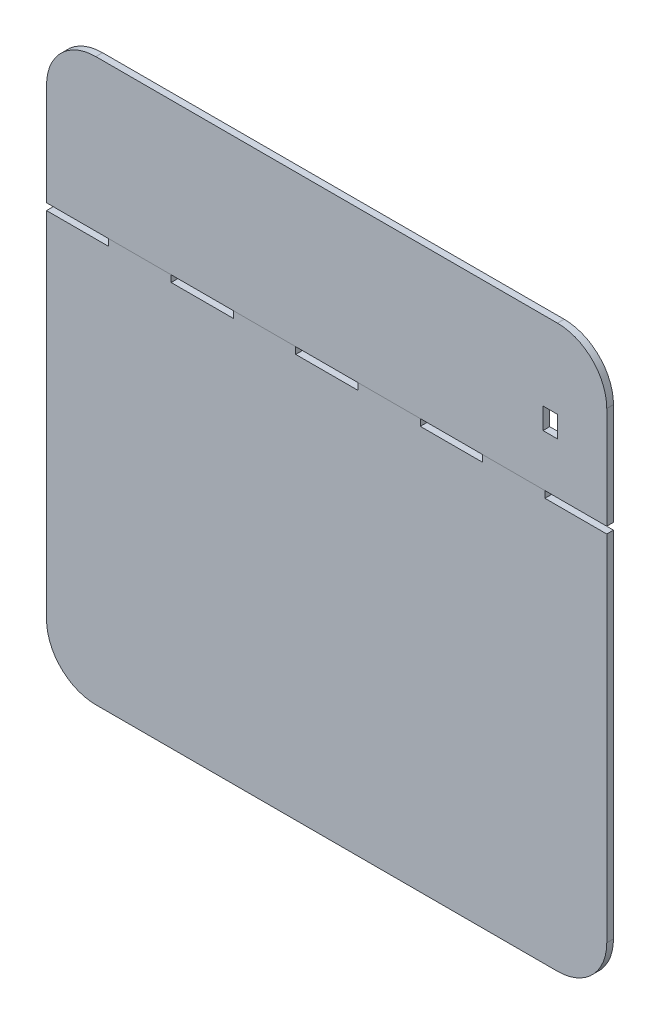
ISO-10303-21;
HEADER;
FILE_DESCRIPTION(('STEP AP214'),'2;1');
FILE_NAME('part.step','',(''),(''),'','','');
FILE_SCHEMA(('AUTOMOTIVE_DESIGN { 1 0 10303 214 1 1 1 1 }'));
ENDSEC;
DATA;
#1=APPLICATION_CONTEXT('core data for automotive mechanical design processes');
#2=APPLICATION_PROTOCOL_DEFINITION('international standard','automotive_design',2000,#1);
#3=PRODUCT_CONTEXT('',#1,'mechanical');
#4=PRODUCT('Part','Part','',(#3));
#5=PRODUCT_RELATED_PRODUCT_CATEGORY('part','',(#4));
#6=PRODUCT_DEFINITION_FORMATION('','',#4);
#7=PRODUCT_DEFINITION_CONTEXT('part definition',#1,'design');
#8=PRODUCT_DEFINITION('design','',#6,#7);
#9=PRODUCT_DEFINITION_SHAPE('','',#8);
#10=(LENGTH_UNIT() NAMED_UNIT(*) SI_UNIT(.MILLI.,.METRE.));
#11=(NAMED_UNIT(*) PLANE_ANGLE_UNIT() SI_UNIT($,.RADIAN.));
#12=(NAMED_UNIT(*) SI_UNIT($,.STERADIAN.) SOLID_ANGLE_UNIT());
#13=UNCERTAINTY_MEASURE_WITH_UNIT(LENGTH_MEASURE(1.E-05),#10,'distance_accuracy_value','');
#14=(GEOMETRIC_REPRESENTATION_CONTEXT(3) GLOBAL_UNCERTAINTY_ASSIGNED_CONTEXT((#13)) GLOBAL_UNIT_ASSIGNED_CONTEXT((#10,
#11,#12)) REPRESENTATION_CONTEXT('',''));
#15=CARTESIAN_POINT('',(0.,0.,0.));
#16=DIRECTION('',(0.,0.,1.));
#17=DIRECTION('',(1.,0.,0.));
#18=AXIS2_PLACEMENT_3D('',#15,#16,#17);
#19=CARTESIAN_POINT('',(0.,366.,-0.00999999999999959));
#20=DIRECTION('',(0.,-1.,0.));
#21=DIRECTION('',(0.,0.,-1.));
#22=AXIS2_PLACEMENT_3D('',#19,#20,#21);
#23=PLANE('',#22);
#24=DIRECTION('',(1.,0.,0.));
#25=VECTOR('',#24,1.);
#26=CARTESIAN_POINT('',(0.,366.,6.));
#27=LINE('',#26,#25);
#28=CARTESIAN_POINT('',(-1.04083408558608E-13,366.,6.));
#29=VERTEX_POINT('',#28);
#30=CARTESIAN_POINT('',(500.,366.,6.));
#31=VERTEX_POINT('',#30);
#32=EDGE_CURVE('E181',#29,#31,#27,.T.);
#33=ORIENTED_EDGE('',*,*,#32,.F.);
#34=DIRECTION('',(0.,0.,-1.));
#35=VECTOR('',#34,1.);
#36=CARTESIAN_POINT('',(-1.04083408558608E-13,366.,10.));
#37=LINE('',#36,#35);
#38=CARTESIAN_POINT('',(0.,366.,0.));
#39=VERTEX_POINT('',#38);
#40=EDGE_CURVE('E164',#29,#39,#37,.T.);
#41=ORIENTED_EDGE('',*,*,#40,.T.);
#42=DIRECTION('',(1.,0.,0.));
#43=VECTOR('',#42,1.);
#44=CARTESIAN_POINT('',(444.8,366.,0.));
#45=LINE('',#44,#43);
#46=CARTESIAN_POINT('',(500.,366.,0.));
#47=VERTEX_POINT('',#46);
#48=EDGE_CURVE('E184',#39,#47,#45,.T.);
#49=ORIENTED_EDGE('',*,*,#48,.T.);
#50=DIRECTION('',(0.,0.,-1.));
#51=VECTOR('',#50,1.);
#52=CARTESIAN_POINT('',(500.,366.,6.));
#53=LINE('',#52,#51);
#54=EDGE_CURVE('E179',#31,#47,#53,.T.);
#55=ORIENTED_EDGE('',*,*,#54,.F.);
#56=EDGE_LOOP('',(#33,#41,#49,#55));
#57=FACE_BOUND('',#56,.T.);
#58=ADVANCED_FACE('F42',(#57),#23,.T.);
#59=CARTESIAN_POINT('',(0.,0.,6.));
#60=DIRECTION('',(1.,0.,0.));
#61=DIRECTION('',(0.,1.,0.));
#62=AXIS2_PLACEMENT_3D('',#59,#60,#61);
#63=PLANE('',#62);
#64=DIRECTION('',(0.,-1.,0.));
#65=VECTOR('',#64,1.);
#66=CARTESIAN_POINT('',(0.,0.,0.));
#67=LINE('',#66,#65);
#68=CARTESIAN_POINT('',(-1.01271840769201E-13,457.,0.));
#69=VERTEX_POINT('',#68);
#70=EDGE_CURVE('E46',#69,#39,#67,.T.);
#71=ORIENTED_EDGE('',*,*,#70,.T.);
#72=ORIENTED_EDGE('',*,*,#40,.F.);
#73=DIRECTION('',(0.,-1.,0.));
#74=VECTOR('',#73,1.);
#75=CARTESIAN_POINT('',(0.,0.,6.));
#76=LINE('',#75,#74);
#77=CARTESIAN_POINT('',(-1.01271840769201E-13,457.,6.));
#78=VERTEX_POINT('',#77);
#79=EDGE_CURVE('E153',#78,#29,#76,.T.);
#80=ORIENTED_EDGE('',*,*,#79,.F.);
#81=DIRECTION('',(0.,0.,-1.));
#82=VECTOR('',#81,1.);
#83=CARTESIAN_POINT('',(-1.01271840769201E-13,457.,6.));
#84=LINE('',#83,#82);
#85=EDGE_CURVE('E203',#78,#69,#84,.T.);
#86=ORIENTED_EDGE('',*,*,#85,.T.);
#87=EDGE_LOOP('',(#71,#72,#80,#86));
#88=FACE_BOUND('',#87,.T.);
#89=ADVANCED_FACE('F201',(#88),#63,.F.);
#90=CARTESIAN_POINT('',(43.9999999999999,457.,6.));
#91=DIRECTION('',(0.,0.,-1.));
#92=DIRECTION('',(-1.,0.,0.));
#93=AXIS2_PLACEMENT_3D('',#90,#91,#92);
#94=CYLINDRICAL_SURFACE('',#93,44.);
#95=CARTESIAN_POINT('',(43.9999999999999,457.,6.));
#96=DIRECTION('',(0.,0.,-1.));
#97=DIRECTION('',(-1.,0.,0.));
#98=AXIS2_PLACEMENT_3D('',#95,#96,#97);
#99=CIRCLE('',#98,44.);
#100=CARTESIAN_POINT('',(43.9999999999999,501.,6.));
#101=VERTEX_POINT('',#100);
#102=EDGE_CURVE('E209',#101,#78,#99,.F.);
#103=ORIENTED_EDGE('',*,*,#102,.F.);
#104=DIRECTION('',(0.,0.,-1.));
#105=VECTOR('',#104,1.);
#106=CARTESIAN_POINT('',(43.9999999999999,501.,6.));
#107=LINE('',#106,#105);
#108=CARTESIAN_POINT('',(43.9999999999999,501.,0.));
#109=VERTEX_POINT('',#108);
#110=EDGE_CURVE('E215',#109,#101,#107,.F.);
#111=ORIENTED_EDGE('',*,*,#110,.F.);
#112=CARTESIAN_POINT('',(43.9999999999999,457.,0.));
#113=DIRECTION('',(0.,0.,-1.));
#114=DIRECTION('',(-1.,0.,0.));
#115=AXIS2_PLACEMENT_3D('',#112,#113,#114);
#116=CIRCLE('',#115,44.);
#117=EDGE_CURVE('E206',#69,#109,#116,.T.);
#118=ORIENTED_EDGE('',*,*,#117,.F.);
#119=ORIENTED_EDGE('',*,*,#85,.F.);
#120=EDGE_LOOP('',(#103,#111,#118,#119));
#121=FACE_BOUND('',#120,.T.);
#122=ADVANCED_FACE('F227',(#121),#94,.T.);
#123=CARTESIAN_POINT('',(-1.11022302462516E-13,501.,6.));
#124=DIRECTION('',(0.,-1.,0.));
#125=DIRECTION('',(0.,0.,-1.));
#126=AXIS2_PLACEMENT_3D('',#123,#124,#125);
#127=PLANE('',#126);
#128=DIRECTION('',(-1.,0.,0.));
#129=VECTOR('',#128,1.);
#130=CARTESIAN_POINT('',(-1.11022302462516E-13,501.,0.));
#131=LINE('',#130,#129);
#132=CARTESIAN_POINT('',(456.,501.,0.));
#133=VERTEX_POINT('',#132);
#134=EDGE_CURVE('E156',#133,#109,#131,.T.);
#135=ORIENTED_EDGE('',*,*,#134,.T.);
#136=ORIENTED_EDGE('',*,*,#110,.T.);
#137=DIRECTION('',(-1.,0.,0.));
#138=VECTOR('',#137,1.);
#139=CARTESIAN_POINT('',(-1.11022302462516E-13,501.,6.));
#140=LINE('',#139,#138);
#141=CARTESIAN_POINT('',(456.,501.,6.));
#142=VERTEX_POINT('',#141);
#143=EDGE_CURVE('E154',#142,#101,#140,.T.);
#144=ORIENTED_EDGE('',*,*,#143,.F.);
#145=DIRECTION('',(0.,0.,-1.));
#146=VECTOR('',#145,1.);
#147=CARTESIAN_POINT('',(456.,501.,6.));
#148=LINE('',#147,#146);
#149=EDGE_CURVE('E213',#142,#133,#148,.T.);
#150=ORIENTED_EDGE('',*,*,#149,.T.);
#151=EDGE_LOOP('',(#135,#136,#144,#150));
#152=FACE_BOUND('',#151,.T.);
#153=ADVANCED_FACE('F226',(#152),#127,.F.);
#154=CARTESIAN_POINT('',(456.,457.,6.));
#155=DIRECTION('',(0.,0.,-1.));
#156=DIRECTION('',(-1.,0.,0.));
#157=AXIS2_PLACEMENT_3D('',#154,#155,#156);
#158=CYLINDRICAL_SURFACE('',#157,44.);
#159=CARTESIAN_POINT('',(456.,457.,6.));
#160=DIRECTION('',(0.,0.,-1.));
#161=DIRECTION('',(-1.,0.,0.));
#162=AXIS2_PLACEMENT_3D('',#159,#160,#161);
#163=CIRCLE('',#162,44.);
#164=CARTESIAN_POINT('',(500.,457.,6.));
#165=VERTEX_POINT('',#164);
#166=EDGE_CURVE('E207',#165,#142,#163,.F.);
#167=ORIENTED_EDGE('',*,*,#166,.F.);
#168=DIRECTION('',(0.,0.,-1.));
#169=VECTOR('',#168,1.);
#170=CARTESIAN_POINT('',(500.,457.,6.));
#171=LINE('',#170,#169);
#172=CARTESIAN_POINT('',(500.,457.,0.));
#173=VERTEX_POINT('',#172);
#174=EDGE_CURVE('E217',#173,#165,#171,.F.);
#175=ORIENTED_EDGE('',*,*,#174,.F.);
#176=CARTESIAN_POINT('',(456.,457.,0.));
#177=DIRECTION('',(0.,0.,-1.));
#178=DIRECTION('',(-1.,0.,0.));
#179=AXIS2_PLACEMENT_3D('',#176,#177,#178);
#180=CIRCLE('',#179,44.);
#181=EDGE_CURVE('E173',#133,#173,#180,.T.);
#182=ORIENTED_EDGE('',*,*,#181,.F.);
#183=ORIENTED_EDGE('',*,*,#149,.F.);
#184=EDGE_LOOP('',(#167,#175,#182,#183));
#185=FACE_BOUND('',#184,.T.);
#186=ADVANCED_FACE('F224',(#185),#158,.T.);
#187=CARTESIAN_POINT('',(500.,0.,6.));
#188=DIRECTION('',(-1.,0.,0.));
#189=DIRECTION('',(0.,-1.,0.));
#190=AXIS2_PLACEMENT_3D('',#187,#188,#189);
#191=PLANE('',#190);
#192=DIRECTION('',(0.,1.,0.));
#193=VECTOR('',#192,1.);
#194=CARTESIAN_POINT('',(500.,0.,6.));
#195=LINE('',#194,#193);
#196=EDGE_CURVE('E151',#31,#165,#195,.T.);
#197=ORIENTED_EDGE('',*,*,#196,.F.);
#198=ORIENTED_EDGE('',*,*,#54,.T.);
#199=DIRECTION('',(0.,1.,0.));
#200=VECTOR('',#199,1.);
#201=CARTESIAN_POINT('',(500.,0.,0.));
#202=LINE('',#201,#200);
#203=EDGE_CURVE('E157',#47,#173,#202,.T.);
#204=ORIENTED_EDGE('',*,*,#203,.T.);
#205=ORIENTED_EDGE('',*,*,#174,.T.);
#206=EDGE_LOOP('',(#197,#198,#204,#205));
#207=FACE_BOUND('',#206,.T.);
#208=ADVANCED_FACE('F221',(#207),#191,.F.);
#209=CARTESIAN_POINT('',(443.1,430.5,10.));
#210=DIRECTION('',(-1.,0.,0.));
#211=DIRECTION('',(0.,-1.,0.));
#212=AXIS2_PLACEMENT_3D('',#209,#210,#211);
#213=PLANE('',#212);
#214=DIRECTION('',(0.,0.,-1.));
#215=VECTOR('',#214,1.);
#216=CARTESIAN_POINT('',(443.1,411.5,10.));
#217=LINE('',#216,#215);
#218=CARTESIAN_POINT('',(443.1,411.5,6.));
#219=VERTEX_POINT('',#218);
#220=CARTESIAN_POINT('',(443.1,411.5,0.));
#221=VERTEX_POINT('',#220);
#222=EDGE_CURVE('E59',#219,#221,#217,.T.);
#223=ORIENTED_EDGE('',*,*,#222,.T.);
#224=DIRECTION('',(0.,1.,0.));
#225=VECTOR('',#224,1.);
#226=CARTESIAN_POINT('',(443.1,430.5,0.));
#227=LINE('',#226,#225);
#228=CARTESIAN_POINT('',(443.1,430.5,0.));
#229=VERTEX_POINT('',#228);
#230=EDGE_CURVE('E148',#221,#229,#227,.T.);
#231=ORIENTED_EDGE('',*,*,#230,.T.);
#232=DIRECTION('',(0.,0.,-1.));
#233=VECTOR('',#232,1.);
#234=CARTESIAN_POINT('',(443.1,430.5,10.));
#235=LINE('',#234,#233);
#236=CARTESIAN_POINT('',(443.1,430.5,6.));
#237=VERTEX_POINT('',#236);
#238=EDGE_CURVE('E67',#237,#229,#235,.T.);
#239=ORIENTED_EDGE('',*,*,#238,.F.);
#240=DIRECTION('',(0.,1.,0.));
#241=VECTOR('',#240,1.);
#242=CARTESIAN_POINT('',(443.100000000001,1.2945784795037E-12,6.));
#243=LINE('',#242,#241);
#244=EDGE_CURVE('E129',#219,#237,#243,.T.);
#245=ORIENTED_EDGE('',*,*,#244,.F.);
#246=EDGE_LOOP('',(#223,#231,#239,#245));
#247=FACE_BOUND('',#246,.T.);
#248=ADVANCED_FACE('F130',(#247),#213,.F.);
#249=CARTESIAN_POINT('',(456.,411.5,10.));
#250=DIRECTION('',(0.,-1.,0.));
#251=DIRECTION('',(1.,0.,0.));
#252=AXIS2_PLACEMENT_3D('',#249,#250,#251);
#253=PLANE('',#252);
#254=DIRECTION('',(0.,0.,-1.));
#255=VECTOR('',#254,1.);
#256=CARTESIAN_POINT('',(456.,411.5,10.));
#257=LINE('',#256,#255);
#258=CARTESIAN_POINT('',(456.,411.5,6.));
#259=VERTEX_POINT('',#258);
#260=CARTESIAN_POINT('',(456.,411.5,0.));
#261=VERTEX_POINT('',#260);
#262=EDGE_CURVE('E126',#259,#261,#257,.T.);
#263=ORIENTED_EDGE('',*,*,#262,.T.);
#264=DIRECTION('',(-1.,0.,0.));
#265=VECTOR('',#264,1.);
#266=CARTESIAN_POINT('',(456.,411.5,0.));
#267=LINE('',#266,#265);
#268=EDGE_CURVE('E51',#261,#221,#267,.T.);
#269=ORIENTED_EDGE('',*,*,#268,.T.);
#270=ORIENTED_EDGE('',*,*,#222,.F.);
#271=DIRECTION('',(-1.,0.,0.));
#272=VECTOR('',#271,1.);
#273=CARTESIAN_POINT('',(-1.77076269237694E-12,411.499999999998,6.));
#274=LINE('',#273,#272);
#275=EDGE_CURVE('E122',#259,#219,#274,.T.);
#276=ORIENTED_EDGE('',*,*,#275,.F.);
#277=EDGE_LOOP('',(#263,#269,#270,#276));
#278=FACE_BOUND('',#277,.T.);
#279=ADVANCED_FACE('F120',(#278),#253,.F.);
#280=CARTESIAN_POINT('',(456.,430.5,10.));
#281=DIRECTION('',(1.,0.,0.));
#282=DIRECTION('',(0.,0.,-1.));
#283=AXIS2_PLACEMENT_3D('',#280,#281,#282);
#284=PLANE('',#283);
#285=DIRECTION('',(0.,0.,-1.));
#286=VECTOR('',#285,1.);
#287=CARTESIAN_POINT('',(456.,430.5,10.));
#288=LINE('',#287,#286);
#289=CARTESIAN_POINT('',(456.,430.5,6.));
#290=VERTEX_POINT('',#289);
#291=CARTESIAN_POINT('',(456.,430.5,0.));
#292=VERTEX_POINT('',#291);
#293=EDGE_CURVE('E139',#290,#292,#288,.T.);
#294=ORIENTED_EDGE('',*,*,#293,.T.);
#295=DIRECTION('',(0.,-1.,0.));
#296=VECTOR('',#295,1.);
#297=CARTESIAN_POINT('',(456.,430.5,0.));
#298=LINE('',#297,#296);
#299=EDGE_CURVE('E12',#292,#261,#298,.T.);
#300=ORIENTED_EDGE('',*,*,#299,.T.);
#301=ORIENTED_EDGE('',*,*,#262,.F.);
#302=DIRECTION('',(0.,-1.,0.));
#303=VECTOR('',#302,1.);
#304=CARTESIAN_POINT('',(456.,0.,6.));
#305=LINE('',#304,#303);
#306=EDGE_CURVE('E138',#290,#259,#305,.T.);
#307=ORIENTED_EDGE('',*,*,#306,.F.);
#308=EDGE_LOOP('',(#294,#300,#301,#307));
#309=FACE_BOUND('',#308,.T.);
#310=ADVANCED_FACE('F191',(#309),#284,.F.);
#311=CARTESIAN_POINT('',(456.,430.5,10.));
#312=DIRECTION('',(0.,1.,0.));
#313=DIRECTION('',(-1.,0.,0.));
#314=AXIS2_PLACEMENT_3D('',#311,#312,#313);
#315=PLANE('',#314);
#316=ORIENTED_EDGE('',*,*,#238,.T.);
#317=DIRECTION('',(1.,0.,0.));
#318=VECTOR('',#317,1.);
#319=CARTESIAN_POINT('',(456.,430.5,0.));
#320=LINE('',#319,#318);
#321=EDGE_CURVE('E144',#229,#292,#320,.T.);
#322=ORIENTED_EDGE('',*,*,#321,.T.);
#323=ORIENTED_EDGE('',*,*,#293,.F.);
#324=DIRECTION('',(1.,0.,0.));
#325=VECTOR('',#324,1.);
#326=CARTESIAN_POINT('',(1.85252330271756E-12,430.500000000002,6.));
#327=LINE('',#326,#325);
#328=EDGE_CURVE('E133',#237,#290,#327,.T.);
#329=ORIENTED_EDGE('',*,*,#328,.F.);
#330=EDGE_LOOP('',(#316,#322,#323,#329));
#331=FACE_BOUND('',#330,.T.);
#332=ADVANCED_FACE('F187',(#331),#315,.F.);
#333=CARTESIAN_POINT('',(0.,0.,6.));
#334=DIRECTION('',(0.,0.,-1.));
#335=DIRECTION('',(-1.,0.,0.));
#336=AXIS2_PLACEMENT_3D('',#333,#334,#335);
#337=PLANE('',#336);
#338=ORIENTED_EDGE('',*,*,#328,.T.);
#339=ORIENTED_EDGE('',*,*,#306,.T.);
#340=ORIENTED_EDGE('',*,*,#275,.T.);
#341=ORIENTED_EDGE('',*,*,#244,.T.);
#342=EDGE_LOOP('',(#338,#339,#340,#341));
#343=FACE_BOUND('',#342,.T.);
#344=ORIENTED_EDGE('',*,*,#79,.T.);
#345=ORIENTED_EDGE('',*,*,#32,.T.);
#346=ORIENTED_EDGE('',*,*,#196,.T.);
#347=ORIENTED_EDGE('',*,*,#166,.T.);
#348=ORIENTED_EDGE('',*,*,#143,.T.);
#349=ORIENTED_EDGE('',*,*,#102,.T.);
#350=EDGE_LOOP('',(#344,#345,#346,#347,#348,#349));
#351=FACE_BOUND('',#350,.T.);
#352=ADVANCED_FACE('F136',(#343,#351),#337,.F.);
#353=CARTESIAN_POINT('',(0.,0.,0.));
#354=DIRECTION('',(0.,0.,-1.));
#355=DIRECTION('',(-1.,0.,0.));
#356=AXIS2_PLACEMENT_3D('',#353,#354,#355);
#357=PLANE('',#356);
#358=ORIENTED_EDGE('',*,*,#299,.F.);
#359=ORIENTED_EDGE('',*,*,#321,.F.);
#360=ORIENTED_EDGE('',*,*,#230,.F.);
#361=ORIENTED_EDGE('',*,*,#268,.F.);
#362=EDGE_LOOP('',(#358,#359,#360,#361));
#363=FACE_BOUND('',#362,.T.);
#364=ORIENTED_EDGE('',*,*,#48,.F.);
#365=ORIENTED_EDGE('',*,*,#70,.F.);
#366=ORIENTED_EDGE('',*,*,#117,.T.);
#367=ORIENTED_EDGE('',*,*,#134,.F.);
#368=ORIENTED_EDGE('',*,*,#181,.T.);
#369=ORIENTED_EDGE('',*,*,#203,.F.);
#370=EDGE_LOOP('',(#364,#365,#366,#367,#368,#369));
#371=FACE_BOUND('',#370,.T.);
#372=ADVANCED_FACE('F44',(#363,#371),#357,.T.);
#373=CLOSED_SHELL('',(#58,#89,#122,#153,#186,#208,#248,#279,#310,#332,#352,#372));
#374=MANIFOLD_SOLID_BREP('B2',#373);
#375=CARTESIAN_POINT('',(0.,366.,-0.00999999999999959));
#376=DIRECTION('',(0.,-1.,0.));
#377=DIRECTION('',(0.,0.,-1.));
#378=AXIS2_PLACEMENT_3D('',#375,#376,#377);
#379=PLANE('',#378);
#380=DIRECTION('',(-1.,0.,0.));
#381=VECTOR('',#380,1.);
#382=CARTESIAN_POINT('',(0.,366.,0.));
#383=LINE('',#382,#381);
#384=CARTESIAN_POINT('',(444.8,366.,0.));
#385=VERTEX_POINT('',#384);
#386=CARTESIAN_POINT('',(389.1,366.,0.));
#387=VERTEX_POINT('',#386);
#388=EDGE_CURVE('E665',#385,#387,#383,.T.);
#389=ORIENTED_EDGE('',*,*,#388,.T.);
#390=DIRECTION('',(0.,0.,-1.));
#391=VECTOR('',#390,1.);
#392=CARTESIAN_POINT('',(389.1,366.,10.));
#393=LINE('',#392,#391);
#394=CARTESIAN_POINT('',(389.1,366.,6.));
#395=VERTEX_POINT('',#394);
#396=EDGE_CURVE('E559',#395,#387,#393,.T.);
#397=ORIENTED_EDGE('',*,*,#396,.F.);
#398=DIRECTION('',(-1.,0.,0.));
#399=VECTOR('',#398,1.);
#400=CARTESIAN_POINT('',(0.,366.,6.));
#401=LINE('',#400,#399);
#402=CARTESIAN_POINT('',(444.8,366.,6.));
#403=VERTEX_POINT('',#402);
#404=EDGE_CURVE('E660',#403,#395,#401,.T.);
#405=ORIENTED_EDGE('',*,*,#404,.F.);
#406=DIRECTION('',(0.,0.,-1.));
#407=VECTOR('',#406,1.);
#408=CARTESIAN_POINT('',(444.8,366.,10.));
#409=LINE('',#408,#407);
#410=EDGE_CURVE('E40',#403,#385,#409,.T.);
#411=ORIENTED_EDGE('',*,*,#410,.T.);
#412=EDGE_LOOP('',(#389,#397,#405,#411));
#413=FACE_BOUND('',#412,.T.);
#414=ADVANCED_FACE('F347',(#413),#379,.F.);
#415=CARTESIAN_POINT('',(333.6,366.,0.));
#416=VERTEX_POINT('',#415);
#417=CARTESIAN_POINT('',(277.9,366.,0.));
#418=VERTEX_POINT('',#417);
#419=EDGE_CURVE('E516',#416,#418,#383,.T.);
#420=ORIENTED_EDGE('',*,*,#419,.T.);
#421=DIRECTION('',(0.,0.,-1.));
#422=VECTOR('',#421,1.);
#423=CARTESIAN_POINT('',(277.9,366.,10.));
#424=LINE('',#423,#422);
#425=CARTESIAN_POINT('',(277.9,366.,6.));
#426=VERTEX_POINT('',#425);
#427=EDGE_CURVE('E544',#426,#418,#424,.T.);
#428=ORIENTED_EDGE('',*,*,#427,.F.);
#429=CARTESIAN_POINT('',(333.6,366.,6.));
#430=VERTEX_POINT('',#429);
#431=EDGE_CURVE('E664',#430,#426,#401,.T.);
#432=ORIENTED_EDGE('',*,*,#431,.F.);
#433=DIRECTION('',(0.,0.,-1.));
#434=VECTOR('',#433,1.);
#435=CARTESIAN_POINT('',(333.6,366.,10.));
#436=LINE('',#435,#434);
#437=EDGE_CURVE('E355',#430,#416,#436,.T.);
#438=ORIENTED_EDGE('',*,*,#437,.T.);
#439=EDGE_LOOP('',(#420,#428,#432,#438));
#440=FACE_BOUND('',#439,.T.);
#441=ADVANCED_FACE('F673',(#440),#379,.F.);
#442=CARTESIAN_POINT('',(111.2,366.,6.));
#443=VERTEX_POINT('',#442);
#444=CARTESIAN_POINT('',(55.4999999999999,366.,6.));
#445=VERTEX_POINT('',#444);
#446=EDGE_CURVE('E657',#443,#445,#401,.T.);
#447=ORIENTED_EDGE('',*,*,#446,.F.);
#448=DIRECTION('',(0.,0.,-1.));
#449=VECTOR('',#448,1.);
#450=CARTESIAN_POINT('',(111.2,366.,10.));
#451=LINE('',#450,#449);
#452=CARTESIAN_POINT('',(111.2,366.,0.));
#453=VERTEX_POINT('',#452);
#454=EDGE_CURVE('E532',#443,#453,#451,.T.);
#455=ORIENTED_EDGE('',*,*,#454,.T.);
#456=CARTESIAN_POINT('',(55.4999999999999,366.,0.));
#457=VERTEX_POINT('',#456);
#458=EDGE_CURVE('E350',#453,#457,#383,.T.);
#459=ORIENTED_EDGE('',*,*,#458,.T.);
#460=DIRECTION('',(0.,0.,-1.));
#461=VECTOR('',#460,1.);
#462=CARTESIAN_POINT('',(55.4999999999999,366.,10.));
#463=LINE('',#462,#461);
#464=EDGE_CURVE('E606',#445,#457,#463,.T.);
#465=ORIENTED_EDGE('',*,*,#464,.F.);
#466=EDGE_LOOP('',(#447,#455,#459,#465));
#467=FACE_BOUND('',#466,.T.);
#468=ADVANCED_FACE('F734',(#467),#379,.F.);
#469=CARTESIAN_POINT('',(222.4,366.,0.));
#470=VERTEX_POINT('',#469);
#471=CARTESIAN_POINT('',(166.7,366.,0.));
#472=VERTEX_POINT('',#471);
#473=EDGE_CURVE('E510',#470,#472,#383,.T.);
#474=ORIENTED_EDGE('',*,*,#473,.T.);
#475=DIRECTION('',(0.,0.,-1.));
#476=VECTOR('',#475,1.);
#477=CARTESIAN_POINT('',(166.7,366.,10.));
#478=LINE('',#477,#476);
#479=CARTESIAN_POINT('',(166.7,366.,6.));
#480=VERTEX_POINT('',#479);
#481=EDGE_CURVE('E495',#480,#472,#478,.T.);
#482=ORIENTED_EDGE('',*,*,#481,.F.);
#483=CARTESIAN_POINT('',(222.4,366.,6.));
#484=VERTEX_POINT('',#483);
#485=EDGE_CURVE('E659',#484,#480,#401,.T.);
#486=ORIENTED_EDGE('',*,*,#485,.F.);
#487=DIRECTION('',(0.,0.,-1.));
#488=VECTOR('',#487,1.);
#489=CARTESIAN_POINT('',(222.4,366.,10.));
#490=LINE('',#489,#488);
#491=EDGE_CURVE('E512',#484,#470,#490,.T.);
#492=ORIENTED_EDGE('',*,*,#491,.T.);
#493=EDGE_LOOP('',(#474,#482,#486,#492));
#494=FACE_BOUND('',#493,.T.);
#495=ADVANCED_FACE('F511',(#494),#379,.F.);
#496=CARTESIAN_POINT('',(0.,0.,6.));
#497=DIRECTION('',(1.,0.,0.));
#498=DIRECTION('',(0.,1.,0.));
#499=AXIS2_PLACEMENT_3D('',#496,#497,#498);
#500=PLANE('',#499);
#501=DIRECTION('',(0.,-1.,0.));
#502=VECTOR('',#501,1.);
#503=CARTESIAN_POINT('',(0.,0.,6.));
#504=LINE('',#503,#502);
#505=CARTESIAN_POINT('',(-1.11022302462516E-13,360.,6.));
#506=VERTEX_POINT('',#505);
#507=CARTESIAN_POINT('',(0.,44.,6.));
#508=VERTEX_POINT('',#507);
#509=EDGE_CURVE('E620',#506,#508,#504,.T.);
#510=ORIENTED_EDGE('',*,*,#509,.F.);
#511=DIRECTION('',(0.,0.,-1.));
#512=VECTOR('',#511,1.);
#513=CARTESIAN_POINT('',(-1.11022302462516E-13,360.,10.));
#514=LINE('',#513,#512);
#515=CARTESIAN_POINT('',(-1.11022302462516E-13,360.,0.));
#516=VERTEX_POINT('',#515);
#517=EDGE_CURVE('E607',#506,#516,#514,.T.);
#518=ORIENTED_EDGE('',*,*,#517,.T.);
#519=DIRECTION('',(0.,-1.,0.));
#520=VECTOR('',#519,1.);
#521=CARTESIAN_POINT('',(0.,0.,0.));
#522=LINE('',#521,#520);
#523=CARTESIAN_POINT('',(0.,44.,0.));
#524=VERTEX_POINT('',#523);
#525=EDGE_CURVE('E619',#516,#524,#522,.T.);
#526=ORIENTED_EDGE('',*,*,#525,.T.);
#527=DIRECTION('',(0.,0.,-1.));
#528=VECTOR('',#527,1.);
#529=CARTESIAN_POINT('',(0.,44.,6.));
#530=LINE('',#529,#528);
#531=EDGE_CURVE('E645',#524,#508,#530,.F.);
#532=ORIENTED_EDGE('',*,*,#531,.T.);
#533=EDGE_LOOP('',(#510,#518,#526,#532));
#534=FACE_BOUND('',#533,.T.);
#535=ADVANCED_FACE('F726',(#534),#500,.F.);
#536=CARTESIAN_POINT('',(44.,44.,6.));
#537=DIRECTION('',(0.,0.,-1.));
#538=DIRECTION('',(-1.,0.,0.));
#539=AXIS2_PLACEMENT_3D('',#536,#537,#538);
#540=CYLINDRICAL_SURFACE('',#539,44.);
#541=CARTESIAN_POINT('',(44.,44.,6.));
#542=DIRECTION('',(0.,0.,-1.));
#543=DIRECTION('',(-1.,0.,0.));
#544=AXIS2_PLACEMENT_3D('',#541,#542,#543);
#545=CIRCLE('',#544,44.);
#546=CARTESIAN_POINT('',(44.,0.,6.));
#547=VERTEX_POINT('',#546);
#548=EDGE_CURVE('E650',#508,#547,#545,.F.);
#549=ORIENTED_EDGE('',*,*,#548,.F.);
#550=ORIENTED_EDGE('',*,*,#531,.F.);
#551=CARTESIAN_POINT('',(44.,44.,0.));
#552=DIRECTION('',(0.,0.,-1.));
#553=DIRECTION('',(-1.,0.,0.));
#554=AXIS2_PLACEMENT_3D('',#551,#552,#553);
#555=CIRCLE('',#554,44.);
#556=CARTESIAN_POINT('',(44.,0.,0.));
#557=VERTEX_POINT('',#556);
#558=EDGE_CURVE('E642',#557,#524,#555,.T.);
#559=ORIENTED_EDGE('',*,*,#558,.F.);
#560=DIRECTION('',(0.,0.,-1.));
#561=VECTOR('',#560,1.);
#562=CARTESIAN_POINT('',(44.,0.,6.));
#563=LINE('',#562,#561);
#564=EDGE_CURVE('E637',#547,#557,#563,.T.);
#565=ORIENTED_EDGE('',*,*,#564,.F.);
#566=EDGE_LOOP('',(#549,#550,#559,#565));
#567=FACE_BOUND('',#566,.T.);
#568=ADVANCED_FACE('F719',(#567),#540,.T.);
#569=CARTESIAN_POINT('',(0.,0.,6.));
#570=DIRECTION('',(0.,1.,0.));
#571=DIRECTION('',(0.,0.,1.));
#572=AXIS2_PLACEMENT_3D('',#569,#570,#571);
#573=PLANE('',#572);
#574=DIRECTION('',(1.,0.,0.));
#575=VECTOR('',#574,1.);
#576=CARTESIAN_POINT('',(0.,0.,6.));
#577=LINE('',#576,#575);
#578=CARTESIAN_POINT('',(456.,0.,6.));
#579=VERTEX_POINT('',#578);
#580=EDGE_CURVE('E622',#547,#579,#577,.T.);
#581=ORIENTED_EDGE('',*,*,#580,.F.);
#582=ORIENTED_EDGE('',*,*,#564,.T.);
#583=DIRECTION('',(1.,0.,0.));
#584=VECTOR('',#583,1.);
#585=CARTESIAN_POINT('',(0.,0.,0.));
#586=LINE('',#585,#584);
#587=CARTESIAN_POINT('',(456.,0.,0.));
#588=VERTEX_POINT('',#587);
#589=EDGE_CURVE('E631',#557,#588,#586,.T.);
#590=ORIENTED_EDGE('',*,*,#589,.T.);
#591=DIRECTION('',(0.,0.,-1.));
#592=VECTOR('',#591,1.);
#593=CARTESIAN_POINT('',(456.,0.,6.));
#594=LINE('',#593,#592);
#595=EDGE_CURVE('E629',#588,#579,#594,.F.);
#596=ORIENTED_EDGE('',*,*,#595,.T.);
#597=EDGE_LOOP('',(#581,#582,#590,#596));
#598=FACE_BOUND('',#597,.T.);
#599=ADVANCED_FACE('F715',(#598),#573,.F.);
#600=CARTESIAN_POINT('',(456.,44.,6.));
#601=DIRECTION('',(0.,0.,-1.));
#602=DIRECTION('',(-1.,0.,0.));
#603=AXIS2_PLACEMENT_3D('',#600,#601,#602);
#604=CYLINDRICAL_SURFACE('',#603,44.);
#605=CARTESIAN_POINT('',(456.,44.,6.));
#606=DIRECTION('',(0.,0.,-1.));
#607=DIRECTION('',(-1.,0.,0.));
#608=AXIS2_PLACEMENT_3D('',#605,#606,#607);
#609=CIRCLE('',#608,44.);
#610=CARTESIAN_POINT('',(500.,44.,6.));
#611=VERTEX_POINT('',#610);
#612=EDGE_CURVE('E648',#579,#611,#609,.F.);
#613=ORIENTED_EDGE('',*,*,#612,.F.);
#614=ORIENTED_EDGE('',*,*,#595,.F.);
#615=CARTESIAN_POINT('',(456.,44.,0.));
#616=DIRECTION('',(0.,0.,-1.));
#617=DIRECTION('',(-1.,0.,0.));
#618=AXIS2_PLACEMENT_3D('',#615,#616,#617);
#619=CIRCLE('',#618,44.);
#620=CARTESIAN_POINT('',(500.,44.,0.));
#621=VERTEX_POINT('',#620);
#622=EDGE_CURVE('E640',#621,#588,#619,.T.);
#623=ORIENTED_EDGE('',*,*,#622,.F.);
#624=DIRECTION('',(0.,0.,-1.));
#625=VECTOR('',#624,1.);
#626=CARTESIAN_POINT('',(500.,44.,6.));
#627=LINE('',#626,#625);
#628=EDGE_CURVE('E652',#611,#621,#627,.T.);
#629=ORIENTED_EDGE('',*,*,#628,.F.);
#630=EDGE_LOOP('',(#613,#614,#623,#629));
#631=FACE_BOUND('',#630,.T.);
#632=ADVANCED_FACE('F710',(#631),#604,.T.);
#633=CARTESIAN_POINT('',(500.,0.,6.));
#634=DIRECTION('',(-1.,0.,0.));
#635=DIRECTION('',(0.,-1.,0.));
#636=AXIS2_PLACEMENT_3D('',#633,#634,#635);
#637=PLANE('',#636);
#638=DIRECTION('',(0.,1.,0.));
#639=VECTOR('',#638,1.);
#640=CARTESIAN_POINT('',(500.,0.,0.));
#641=LINE('',#640,#639);
#642=CARTESIAN_POINT('',(500.,360.,0.));
#643=VERTEX_POINT('',#642);
#644=EDGE_CURVE('E623',#621,#643,#641,.T.);
#645=ORIENTED_EDGE('',*,*,#644,.T.);
#646=DIRECTION('',(0.,0.,1.));
#647=VECTOR('',#646,1.);
#648=CARTESIAN_POINT('',(500.,360.,6.));
#649=LINE('',#648,#647);
#650=CARTESIAN_POINT('',(500.,360.,6.));
#651=VERTEX_POINT('',#650);
#652=EDGE_CURVE('E570',#643,#651,#649,.T.);
#653=ORIENTED_EDGE('',*,*,#652,.T.);
#654=DIRECTION('',(0.,1.,0.));
#655=VECTOR('',#654,1.);
#656=CARTESIAN_POINT('',(500.,0.,6.));
#657=LINE('',#656,#655);
#658=EDGE_CURVE('E626',#611,#651,#657,.T.);
#659=ORIENTED_EDGE('',*,*,#658,.F.);
#660=ORIENTED_EDGE('',*,*,#628,.T.);
#661=EDGE_LOOP('',(#645,#653,#659,#660));
#662=FACE_BOUND('',#661,.T.);
#663=ADVANCED_FACE('F705',(#662),#637,.F.);
#664=CARTESIAN_POINT('',(-1.11022302462516E-13,360.,10.));
#665=DIRECTION('',(0.,-1.,0.));
#666=DIRECTION('',(0.,0.,-1.));
#667=AXIS2_PLACEMENT_3D('',#664,#665,#666);
#668=PLANE('',#667);
#669=DIRECTION('',(0.,0.,-1.));
#670=VECTOR('',#669,1.);
#671=CARTESIAN_POINT('',(55.4999999999999,360.,10.));
#672=LINE('',#671,#670);
#673=CARTESIAN_POINT('',(55.4999999999999,360.,6.));
#674=VERTEX_POINT('',#673);
#675=CARTESIAN_POINT('',(55.4999999999999,360.,0.));
#676=VERTEX_POINT('',#675);
#677=EDGE_CURVE('E611',#674,#676,#672,.T.);
#678=ORIENTED_EDGE('',*,*,#677,.T.);
#679=DIRECTION('',(-1.,0.,0.));
#680=VECTOR('',#679,1.);
#681=CARTESIAN_POINT('',(-1.11022302462516E-13,360.,0.));
#682=LINE('',#681,#680);
#683=EDGE_CURVE('E604',#676,#516,#682,.T.);
#684=ORIENTED_EDGE('',*,*,#683,.T.);
#685=ORIENTED_EDGE('',*,*,#517,.F.);
#686=DIRECTION('',(-1.,0.,0.));
#687=VECTOR('',#686,1.);
#688=CARTESIAN_POINT('',(0.,360.,6.));
#689=LINE('',#688,#687);
#690=EDGE_CURVE('E616',#674,#506,#689,.T.);
#691=ORIENTED_EDGE('',*,*,#690,.F.);
#692=EDGE_LOOP('',(#678,#684,#685,#691));
#693=FACE_BOUND('',#692,.T.);
#694=ADVANCED_FACE('F728',(#693),#668,.F.);
#695=CARTESIAN_POINT('',(333.6,360.,10.));
#696=DIRECTION('',(0.,-1.,0.));
#697=DIRECTION('',(0.,0.,-1.));
#698=AXIS2_PLACEMENT_3D('',#695,#696,#697);
#699=PLANE('',#698);
#700=DIRECTION('',(0.,0.,-1.));
#701=VECTOR('',#700,1.);
#702=CARTESIAN_POINT('',(389.1,360.,10.));
#703=LINE('',#702,#701);
#704=CARTESIAN_POINT('',(389.1,360.,6.));
#705=VERTEX_POINT('',#704);
#706=CARTESIAN_POINT('',(389.1,360.,0.));
#707=VERTEX_POINT('',#706);
#708=EDGE_CURVE('E561',#705,#707,#703,.T.);
#709=ORIENTED_EDGE('',*,*,#708,.T.);
#710=DIRECTION('',(-1.,0.,0.));
#711=VECTOR('',#710,1.);
#712=CARTESIAN_POINT('',(333.6,360.,0.));
#713=LINE('',#712,#711);
#714=CARTESIAN_POINT('',(333.6,360.,0.));
#715=VERTEX_POINT('',#714);
#716=EDGE_CURVE('E556',#707,#715,#713,.T.);
#717=ORIENTED_EDGE('',*,*,#716,.T.);
#718=DIRECTION('',(0.,0.,-1.));
#719=VECTOR('',#718,1.);
#720=CARTESIAN_POINT('',(333.6,360.,10.));
#721=LINE('',#720,#719);
#722=CARTESIAN_POINT('',(333.6,360.,6.));
#723=VERTEX_POINT('',#722);
#724=EDGE_CURVE('E538',#723,#715,#721,.T.);
#725=ORIENTED_EDGE('',*,*,#724,.F.);
#726=DIRECTION('',(-1.,0.,0.));
#727=VECTOR('',#726,1.);
#728=CARTESIAN_POINT('',(0.,360.,6.));
#729=LINE('',#728,#727);
#730=EDGE_CURVE('E579',#705,#723,#729,.T.);
#731=ORIENTED_EDGE('',*,*,#730,.F.);
#732=EDGE_LOOP('',(#709,#717,#725,#731));
#733=FACE_BOUND('',#732,.T.);
#734=ADVANCED_FACE('F690',(#733),#699,.F.);
#735=CARTESIAN_POINT('',(222.4,360.,10.));
#736=DIRECTION('',(0.,-1.,0.));
#737=DIRECTION('',(0.,0.,-1.));
#738=AXIS2_PLACEMENT_3D('',#735,#736,#737);
#739=PLANE('',#738);
#740=DIRECTION('',(0.,0.,-1.));
#741=VECTOR('',#740,1.);
#742=CARTESIAN_POINT('',(277.9,360.,10.));
#743=LINE('',#742,#741);
#744=CARTESIAN_POINT('',(277.9,360.,6.));
#745=VERTEX_POINT('',#744);
#746=CARTESIAN_POINT('',(277.9,360.,0.));
#747=VERTEX_POINT('',#746);
#748=EDGE_CURVE('E546',#745,#747,#743,.T.);
#749=ORIENTED_EDGE('',*,*,#748,.T.);
#750=DIRECTION('',(-1.,0.,0.));
#751=VECTOR('',#750,1.);
#752=CARTESIAN_POINT('',(222.4,360.,0.));
#753=LINE('',#752,#751);
#754=CARTESIAN_POINT('',(222.4,360.,0.));
#755=VERTEX_POINT('',#754);
#756=EDGE_CURVE('E541',#747,#755,#753,.T.);
#757=ORIENTED_EDGE('',*,*,#756,.T.);
#758=DIRECTION('',(0.,0.,-1.));
#759=VECTOR('',#758,1.);
#760=CARTESIAN_POINT('',(222.4,360.,10.));
#761=LINE('',#760,#759);
#762=CARTESIAN_POINT('',(222.4,360.,6.));
#763=VERTEX_POINT('',#762);
#764=EDGE_CURVE('E525',#763,#755,#761,.T.);
#765=ORIENTED_EDGE('',*,*,#764,.F.);
#766=DIRECTION('',(-1.,0.,0.));
#767=VECTOR('',#766,1.);
#768=CARTESIAN_POINT('',(0.,360.,6.));
#769=LINE('',#768,#767);
#770=EDGE_CURVE('E588',#745,#763,#769,.T.);
#771=ORIENTED_EDGE('',*,*,#770,.F.);
#772=EDGE_LOOP('',(#749,#757,#765,#771));
#773=FACE_BOUND('',#772,.T.);
#774=ADVANCED_FACE('F681',(#773),#739,.F.);
#775=CARTESIAN_POINT('',(0.,0.,6.));
#776=DIRECTION('',(0.,0.,-1.));
#777=DIRECTION('',(-1.,0.,0.));
#778=AXIS2_PLACEMENT_3D('',#775,#776,#777);
#779=PLANE('',#778);
#780=DIRECTION('',(0.,1.,0.));
#781=VECTOR('',#780,1.);
#782=CARTESIAN_POINT('',(444.799999999999,-5.14403334742988E-13,6.));
#783=LINE('',#782,#781);
#784=CARTESIAN_POINT('',(444.8,360.,6.));
#785=VERTEX_POINT('',#784);
#786=EDGE_CURVE('E573',#785,#403,#783,.T.);
#787=ORIENTED_EDGE('',*,*,#786,.T.);
#788=ORIENTED_EDGE('',*,*,#404,.T.);
#789=DIRECTION('',(0.,-1.,0.));
#790=VECTOR('',#789,1.);
#791=CARTESIAN_POINT('',(389.1,0.,6.));
#792=LINE('',#791,#790);
#793=EDGE_CURVE('E576',#395,#705,#792,.T.);
#794=ORIENTED_EDGE('',*,*,#793,.T.);
#795=ORIENTED_EDGE('',*,*,#730,.T.);
#796=DIRECTION('',(0.,1.,0.));
#797=VECTOR('',#796,1.);
#798=CARTESIAN_POINT('',(333.6,-3.85802501057241E-13,6.));
#799=LINE('',#798,#797);
#800=EDGE_CURVE('E582',#723,#430,#799,.T.);
#801=ORIENTED_EDGE('',*,*,#800,.T.);
#802=ORIENTED_EDGE('',*,*,#431,.T.);
#803=DIRECTION('',(0.,-1.,0.));
#804=VECTOR('',#803,1.);
#805=CARTESIAN_POINT('',(277.9,0.,6.));
#806=LINE('',#805,#804);
#807=EDGE_CURVE('E585',#426,#745,#806,.T.);
#808=ORIENTED_EDGE('',*,*,#807,.T.);
#809=ORIENTED_EDGE('',*,*,#770,.T.);
#810=DIRECTION('',(0.,1.,0.));
#811=VECTOR('',#810,1.);
#812=CARTESIAN_POINT('',(222.399999999999,-2.57201667371494E-13,6.));
#813=LINE('',#812,#811);
#814=EDGE_CURVE('E591',#763,#484,#813,.T.);
#815=ORIENTED_EDGE('',*,*,#814,.T.);
#816=ORIENTED_EDGE('',*,*,#485,.T.);
#817=DIRECTION('',(0.,-1.,0.));
#818=VECTOR('',#817,1.);
#819=CARTESIAN_POINT('',(166.7,0.,6.));
#820=LINE('',#819,#818);
#821=CARTESIAN_POINT('',(166.7,360.,6.));
#822=VERTEX_POINT('',#821);
#823=EDGE_CURVE('E503',#480,#822,#820,.T.);
#824=ORIENTED_EDGE('',*,*,#823,.T.);
#825=DIRECTION('',(-1.,0.,0.));
#826=VECTOR('',#825,1.);
#827=CARTESIAN_POINT('',(0.,360.,6.));
#828=LINE('',#827,#826);
#829=CARTESIAN_POINT('',(111.2,360.,6.));
#830=VERTEX_POINT('',#829);
#831=EDGE_CURVE('E595',#822,#830,#828,.T.);
#832=ORIENTED_EDGE('',*,*,#831,.T.);
#833=DIRECTION('',(0.,1.,0.));
#834=VECTOR('',#833,1.);
#835=CARTESIAN_POINT('',(111.199999999999,-1.28600833685747E-13,6.));
#836=LINE('',#835,#834);
#837=EDGE_CURVE('E598',#830,#443,#836,.T.);
#838=ORIENTED_EDGE('',*,*,#837,.T.);
#839=ORIENTED_EDGE('',*,*,#446,.T.);
#840=DIRECTION('',(0.,-1.,0.));
#841=VECTOR('',#840,1.);
#842=CARTESIAN_POINT('',(55.4999999999999,0.,6.));
#843=LINE('',#842,#841);
#844=EDGE_CURVE('E610',#445,#674,#843,.T.);
#845=ORIENTED_EDGE('',*,*,#844,.T.);
#846=ORIENTED_EDGE('',*,*,#690,.T.);
#847=ORIENTED_EDGE('',*,*,#509,.T.);
#848=ORIENTED_EDGE('',*,*,#548,.T.);
#849=ORIENTED_EDGE('',*,*,#580,.T.);
#850=ORIENTED_EDGE('',*,*,#612,.T.);
#851=ORIENTED_EDGE('',*,*,#658,.T.);
#852=DIRECTION('',(-1.,0.,0.));
#853=VECTOR('',#852,1.);
#854=CARTESIAN_POINT('',(0.,360.,6.));
#855=LINE('',#854,#853);
#856=EDGE_CURVE('E530',#651,#785,#855,.T.);
#857=ORIENTED_EDGE('',*,*,#856,.T.);
#858=EDGE_LOOP('',(#787,#788,#794,#795,#801,#802,#808,#809,#815,#816,#824,#832,#838,#839,#845,
#846,#847,#848,#849,#850,#851,#857));
#859=FACE_BOUND('',#858,.T.);
#860=ADVANCED_FACE('F669',(#859),#779,.F.);
#861=CARTESIAN_POINT('',(111.2,360.,10.));
#862=DIRECTION('',(0.,-1.,0.));
#863=DIRECTION('',(0.,0.,-1.));
#864=AXIS2_PLACEMENT_3D('',#861,#862,#863);
#865=PLANE('',#864);
#866=DIRECTION('',(0.,0.,-1.));
#867=VECTOR('',#866,1.);
#868=CARTESIAN_POINT('',(166.7,360.,10.));
#869=LINE('',#868,#867);
#870=CARTESIAN_POINT('',(166.7,360.,0.));
#871=VERTEX_POINT('',#870);
#872=EDGE_CURVE('E506',#822,#871,#869,.T.);
#873=ORIENTED_EDGE('',*,*,#872,.T.);
#874=DIRECTION('',(-1.,0.,0.));
#875=VECTOR('',#874,1.);
#876=CARTESIAN_POINT('',(111.2,360.,0.));
#877=LINE('',#876,#875);
#878=CARTESIAN_POINT('',(111.2,360.,0.));
#879=VERTEX_POINT('',#878);
#880=EDGE_CURVE('E507',#871,#879,#877,.T.);
#881=ORIENTED_EDGE('',*,*,#880,.T.);
#882=DIRECTION('',(0.,0.,-1.));
#883=VECTOR('',#882,1.);
#884=CARTESIAN_POINT('',(111.2,360.,10.));
#885=LINE('',#884,#883);
#886=EDGE_CURVE('E528',#830,#879,#885,.T.);
#887=ORIENTED_EDGE('',*,*,#886,.F.);
#888=ORIENTED_EDGE('',*,*,#831,.F.);
#889=EDGE_LOOP('',(#873,#881,#887,#888));
#890=FACE_BOUND('',#889,.T.);
#891=ADVANCED_FACE('F739',(#890),#865,.F.);
#892=CARTESIAN_POINT('',(0.,0.,0.));
#893=DIRECTION('',(0.,0.,-1.));
#894=DIRECTION('',(-1.,0.,0.));
#895=AXIS2_PLACEMENT_3D('',#892,#893,#894);
#896=PLANE('',#895);
#897=ORIENTED_EDGE('',*,*,#388,.F.);
#898=DIRECTION('',(0.,1.,0.));
#899=VECTOR('',#898,1.);
#900=CARTESIAN_POINT('',(444.8,360.,0.));
#901=LINE('',#900,#899);
#902=CARTESIAN_POINT('',(444.8,360.,0.));
#903=VERTEX_POINT('',#902);
#904=EDGE_CURVE('E565',#903,#385,#901,.T.);
#905=ORIENTED_EDGE('',*,*,#904,.F.);
#906=DIRECTION('',(-1.,0.,0.));
#907=VECTOR('',#906,1.);
#908=CARTESIAN_POINT('',(0.,360.,0.));
#909=LINE('',#908,#907);
#910=EDGE_CURVE('E655',#643,#903,#909,.T.);
#911=ORIENTED_EDGE('',*,*,#910,.F.);
#912=ORIENTED_EDGE('',*,*,#644,.F.);
#913=ORIENTED_EDGE('',*,*,#622,.T.);
#914=ORIENTED_EDGE('',*,*,#589,.F.);
#915=ORIENTED_EDGE('',*,*,#558,.T.);
#916=ORIENTED_EDGE('',*,*,#525,.F.);
#917=ORIENTED_EDGE('',*,*,#683,.F.);
#918=DIRECTION('',(0.,-1.,0.));
#919=VECTOR('',#918,1.);
#920=CARTESIAN_POINT('',(55.4999999999999,360.,0.));
#921=LINE('',#920,#919);
#922=EDGE_CURVE('E601',#457,#676,#921,.T.);
#923=ORIENTED_EDGE('',*,*,#922,.F.);
#924=ORIENTED_EDGE('',*,*,#458,.F.);
#925=DIRECTION('',(0.,1.,0.));
#926=VECTOR('',#925,1.);
#927=CARTESIAN_POINT('',(111.2,360.,0.));
#928=LINE('',#927,#926);
#929=EDGE_CURVE('E521',#879,#453,#928,.T.);
#930=ORIENTED_EDGE('',*,*,#929,.F.);
#931=ORIENTED_EDGE('',*,*,#880,.F.);
#932=DIRECTION('',(0.,-1.,0.));
#933=VECTOR('',#932,1.);
#934=CARTESIAN_POINT('',(166.7,360.,0.));
#935=LINE('',#934,#933);
#936=EDGE_CURVE('E500',#472,#871,#935,.T.);
#937=ORIENTED_EDGE('',*,*,#936,.F.);
#938=ORIENTED_EDGE('',*,*,#473,.F.);
#939=DIRECTION('',(0.,1.,0.));
#940=VECTOR('',#939,1.);
#941=CARTESIAN_POINT('',(222.4,360.,0.));
#942=LINE('',#941,#940);
#943=EDGE_CURVE('E535',#755,#470,#942,.T.);
#944=ORIENTED_EDGE('',*,*,#943,.F.);
#945=ORIENTED_EDGE('',*,*,#756,.F.);
#946=DIRECTION('',(0.,-1.,0.));
#947=VECTOR('',#946,1.);
#948=CARTESIAN_POINT('',(277.9,360.,0.));
#949=LINE('',#948,#947);
#950=EDGE_CURVE('E537',#418,#747,#949,.T.);
#951=ORIENTED_EDGE('',*,*,#950,.F.);
#952=ORIENTED_EDGE('',*,*,#419,.F.);
#953=DIRECTION('',(0.,1.,0.));
#954=VECTOR('',#953,1.);
#955=CARTESIAN_POINT('',(333.6,360.,0.));
#956=LINE('',#955,#954);
#957=EDGE_CURVE('E550',#715,#416,#956,.T.);
#958=ORIENTED_EDGE('',*,*,#957,.F.);
#959=ORIENTED_EDGE('',*,*,#716,.F.);
#960=DIRECTION('',(0.,-1.,0.));
#961=VECTOR('',#960,1.);
#962=CARTESIAN_POINT('',(389.1,360.,0.));
#963=LINE('',#962,#961);
#964=EDGE_CURVE('E552',#387,#707,#963,.T.);
#965=ORIENTED_EDGE('',*,*,#964,.F.);
#966=EDGE_LOOP('',(#897,#905,#911,#912,#913,#914,#915,#916,#917,#923,#924,#930,#931,#937,#938,
#944,#945,#951,#952,#958,#959,#965));
#967=FACE_BOUND('',#966,.T.);
#968=ADVANCED_FACE('F518',(#967),#896,.T.);
#969=CARTESIAN_POINT('',(166.7,360.,10.));
#970=DIRECTION('',(1.,0.,0.));
#971=DIRECTION('',(0.,0.,-1.));
#972=AXIS2_PLACEMENT_3D('',#969,#970,#971);
#973=PLANE('',#972);
#974=ORIENTED_EDGE('',*,*,#481,.T.);
#975=ORIENTED_EDGE('',*,*,#936,.T.);
#976=ORIENTED_EDGE('',*,*,#872,.F.);
#977=ORIENTED_EDGE('',*,*,#823,.F.);
#978=EDGE_LOOP('',(#974,#975,#976,#977));
#979=FACE_BOUND('',#978,.T.);
#980=ADVANCED_FACE('F497',(#979),#973,.F.);
#981=CARTESIAN_POINT('',(111.2,360.,10.));
#982=DIRECTION('',(-1.,0.,0.));
#983=DIRECTION('',(0.,-1.,0.));
#984=AXIS2_PLACEMENT_3D('',#981,#982,#983);
#985=PLANE('',#984);
#986=ORIENTED_EDGE('',*,*,#886,.T.);
#987=ORIENTED_EDGE('',*,*,#929,.T.);
#988=ORIENTED_EDGE('',*,*,#454,.F.);
#989=ORIENTED_EDGE('',*,*,#837,.F.);
#990=EDGE_LOOP('',(#986,#987,#988,#989));
#991=FACE_BOUND('',#990,.T.);
#992=ADVANCED_FACE('F736',(#991),#985,.F.);
#993=CARTESIAN_POINT('',(277.9,360.,10.));
#994=DIRECTION('',(1.,0.,0.));
#995=DIRECTION('',(0.,0.,-1.));
#996=AXIS2_PLACEMENT_3D('',#993,#994,#995);
#997=PLANE('',#996);
#998=ORIENTED_EDGE('',*,*,#427,.T.);
#999=ORIENTED_EDGE('',*,*,#950,.T.);
#1000=ORIENTED_EDGE('',*,*,#748,.F.);
#1001=ORIENTED_EDGE('',*,*,#807,.F.);
#1002=EDGE_LOOP('',(#998,#999,#1000,#1001));
#1003=FACE_BOUND('',#1002,.T.);
#1004=ADVANCED_FACE('F678',(#1003),#997,.F.);
#1005=CARTESIAN_POINT('',(222.4,360.,10.));
#1006=DIRECTION('',(-1.,0.,0.));
#1007=DIRECTION('',(0.,-1.,0.));
#1008=AXIS2_PLACEMENT_3D('',#1005,#1006,#1007);
#1009=PLANE('',#1008);
#1010=ORIENTED_EDGE('',*,*,#764,.T.);
#1011=ORIENTED_EDGE('',*,*,#943,.T.);
#1012=ORIENTED_EDGE('',*,*,#491,.F.);
#1013=ORIENTED_EDGE('',*,*,#814,.F.);
#1014=EDGE_LOOP('',(#1010,#1011,#1012,#1013));
#1015=FACE_BOUND('',#1014,.T.);
#1016=ADVANCED_FACE('F684',(#1015),#1009,.F.);
#1017=CARTESIAN_POINT('',(389.1,360.,10.));
#1018=DIRECTION('',(1.,0.,0.));
#1019=DIRECTION('',(0.,0.,-1.));
#1020=AXIS2_PLACEMENT_3D('',#1017,#1018,#1019);
#1021=PLANE('',#1020);
#1022=ORIENTED_EDGE('',*,*,#396,.T.);
#1023=ORIENTED_EDGE('',*,*,#964,.T.);
#1024=ORIENTED_EDGE('',*,*,#708,.F.);
#1025=ORIENTED_EDGE('',*,*,#793,.F.);
#1026=EDGE_LOOP('',(#1022,#1023,#1024,#1025));
#1027=FACE_BOUND('',#1026,.T.);
#1028=ADVANCED_FACE('F695',(#1027),#1021,.F.);
#1029=CARTESIAN_POINT('',(333.6,360.,10.));
#1030=DIRECTION('',(-1.,0.,0.));
#1031=DIRECTION('',(0.,-1.,0.));
#1032=AXIS2_PLACEMENT_3D('',#1029,#1030,#1031);
#1033=PLANE('',#1032);
#1034=ORIENTED_EDGE('',*,*,#724,.T.);
#1035=ORIENTED_EDGE('',*,*,#957,.T.);
#1036=ORIENTED_EDGE('',*,*,#437,.F.);
#1037=ORIENTED_EDGE('',*,*,#800,.F.);
#1038=EDGE_LOOP('',(#1034,#1035,#1036,#1037));
#1039=FACE_BOUND('',#1038,.T.);
#1040=ADVANCED_FACE('F687',(#1039),#1033,.F.);
#1041=CARTESIAN_POINT('',(444.8,360.,10.));
#1042=DIRECTION('',(0.,-1.,0.));
#1043=DIRECTION('',(0.,0.,-1.));
#1044=AXIS2_PLACEMENT_3D('',#1041,#1042,#1043);
#1045=PLANE('',#1044);
#1046=ORIENTED_EDGE('',*,*,#910,.T.);
#1047=DIRECTION('',(0.,0.,-1.));
#1048=VECTOR('',#1047,1.);
#1049=CARTESIAN_POINT('',(444.8,360.,10.));
#1050=LINE('',#1049,#1048);
#1051=EDGE_CURVE('E553',#785,#903,#1050,.T.);
#1052=ORIENTED_EDGE('',*,*,#1051,.F.);
#1053=ORIENTED_EDGE('',*,*,#856,.F.);
#1054=ORIENTED_EDGE('',*,*,#652,.F.);
#1055=EDGE_LOOP('',(#1046,#1052,#1053,#1054));
#1056=FACE_BOUND('',#1055,.T.);
#1057=ADVANCED_FACE('F701',(#1056),#1045,.F.);
#1058=CARTESIAN_POINT('',(444.8,360.,10.));
#1059=DIRECTION('',(-1.,0.,0.));
#1060=DIRECTION('',(0.,-1.,0.));
#1061=AXIS2_PLACEMENT_3D('',#1058,#1059,#1060);
#1062=PLANE('',#1061);
#1063=ORIENTED_EDGE('',*,*,#1051,.T.);
#1064=ORIENTED_EDGE('',*,*,#904,.T.);
#1065=ORIENTED_EDGE('',*,*,#410,.F.);
#1066=ORIENTED_EDGE('',*,*,#786,.F.);
#1067=EDGE_LOOP('',(#1063,#1064,#1065,#1066));
#1068=FACE_BOUND('',#1067,.T.);
#1069=ADVANCED_FACE('F699',(#1068),#1062,.F.);
#1070=CARTESIAN_POINT('',(55.4999999999999,360.,10.));
#1071=DIRECTION('',(1.,0.,0.));
#1072=DIRECTION('',(0.,0.,-1.));
#1073=AXIS2_PLACEMENT_3D('',#1070,#1071,#1072);
#1074=PLANE('',#1073);
#1075=ORIENTED_EDGE('',*,*,#464,.T.);
#1076=ORIENTED_EDGE('',*,*,#922,.T.);
#1077=ORIENTED_EDGE('',*,*,#677,.F.);
#1078=ORIENTED_EDGE('',*,*,#844,.F.);
#1079=EDGE_LOOP('',(#1075,#1076,#1077,#1078));
#1080=FACE_BOUND('',#1079,.T.);
#1081=ADVANCED_FACE('F731',(#1080),#1074,.F.);
#1082=CLOSED_SHELL('',(#414,#441,#468,#495,#535,#568,#599,#632,#663,#694,#734,#774,#860,#891,
#968,#980,#992,#1004,#1016,#1028,#1040,#1057,#1069,#1081));
#1083=MANIFOLD_SOLID_BREP('B6',#1082);
#1084=ADVANCED_BREP_SHAPE_REPRESENTATION('',(#18,#374,#1083),#14);
#1085=SHAPE_DEFINITION_REPRESENTATION(#9,#1084);
ENDSEC;
END-ISO-10303-21;
